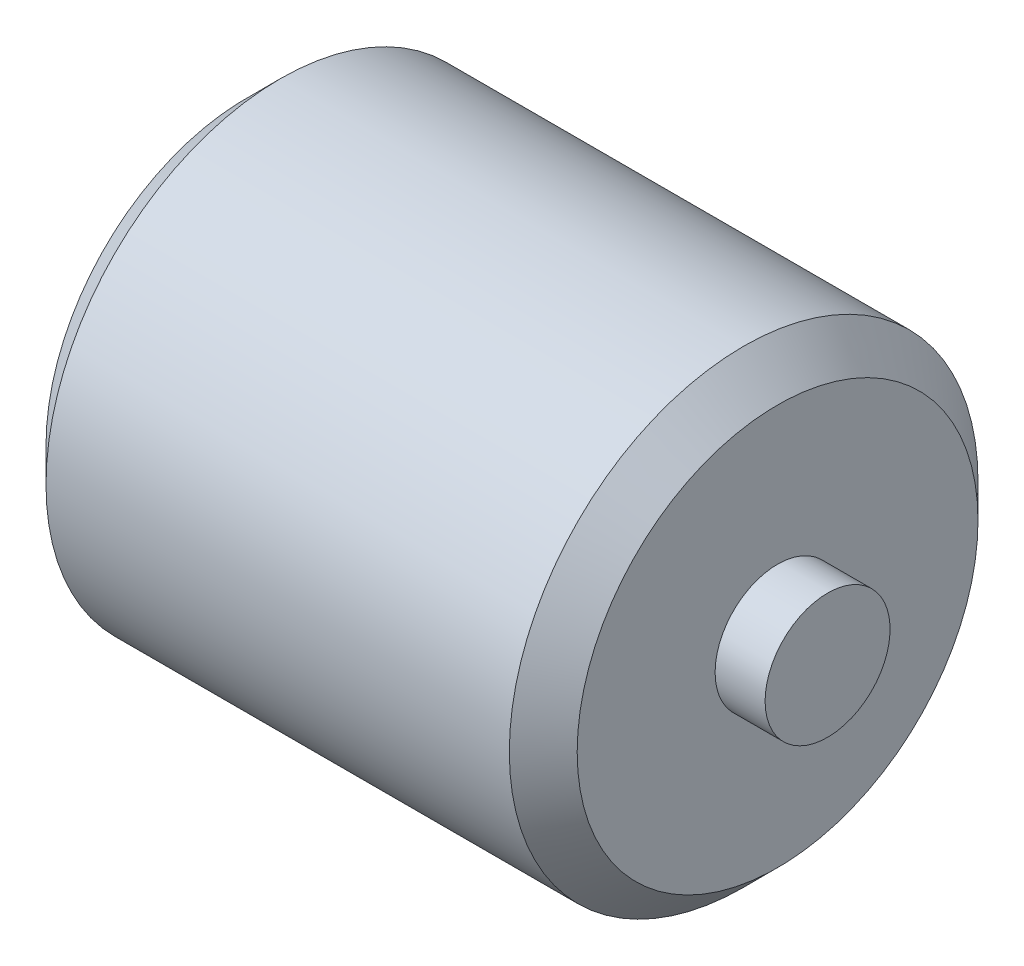
ISO-10303-21;
HEADER;
FILE_DESCRIPTION(('STEP AP214'),'2;1');
FILE_NAME('part.step','',(''),(''),'','','');
FILE_SCHEMA(('AUTOMOTIVE_DESIGN { 1 0 10303 214 1 1 1 1 }'));
ENDSEC;
DATA;
#1=APPLICATION_CONTEXT('core data for automotive mechanical design processes');
#2=APPLICATION_PROTOCOL_DEFINITION('international standard','automotive_design',2000,#1);
#3=PRODUCT_CONTEXT('',#1,'mechanical');
#4=PRODUCT('Part','Part','',(#3));
#5=PRODUCT_RELATED_PRODUCT_CATEGORY('part','',(#4));
#6=PRODUCT_DEFINITION_FORMATION('','',#4);
#7=PRODUCT_DEFINITION_CONTEXT('part definition',#1,'design');
#8=PRODUCT_DEFINITION('design','',#6,#7);
#9=PRODUCT_DEFINITION_SHAPE('','',#8);
#10=(LENGTH_UNIT() NAMED_UNIT(*) SI_UNIT(.MILLI.,.METRE.));
#11=(NAMED_UNIT(*) PLANE_ANGLE_UNIT() SI_UNIT($,.RADIAN.));
#12=(NAMED_UNIT(*) SI_UNIT($,.STERADIAN.) SOLID_ANGLE_UNIT());
#13=UNCERTAINTY_MEASURE_WITH_UNIT(LENGTH_MEASURE(1.E-05),#10,'distance_accuracy_value','');
#14=(GEOMETRIC_REPRESENTATION_CONTEXT(3) GLOBAL_UNCERTAINTY_ASSIGNED_CONTEXT((#13)) GLOBAL_UNIT_ASSIGNED_CONTEXT((#10,
#11,#12)) REPRESENTATION_CONTEXT('',''));
#15=CARTESIAN_POINT('',(0.,0.,0.));
#16=DIRECTION('',(0.,0.,1.));
#17=DIRECTION('',(1.,0.,0.));
#18=AXIS2_PLACEMENT_3D('',#15,#16,#17);
#19=CARTESIAN_POINT('',(-10.,10.,0.));
#20=DIRECTION('',(1.,0.,0.));
#21=DIRECTION('',(0.,0.,-1.));
#22=AXIS2_PLACEMENT_3D('',#19,#20,#21);
#23=PLANE('',#22);
#24=CARTESIAN_POINT('',(-10.,0.,0.));
#25=DIRECTION('',(-1.,0.,0.));
#26=DIRECTION('',(0.,0.,1.));
#27=AXIS2_PLACEMENT_3D('',#24,#25,#26);
#28=CIRCLE('',#27,20.);
#29=CARTESIAN_POINT('',(-10.,0.,20.));
#30=VERTEX_POINT('',#29);
#31=EDGE_CURVE('E10',#30,#30,#28,.T.);
#32=ORIENTED_EDGE('',*,*,#31,.T.);
#33=EDGE_LOOP('',(#32));
#34=FACE_BOUND('',#33,.T.);
#35=ADVANCED_FACE('F38',(#34),#23,.F.);
#36=CARTESIAN_POINT('',(0.,0.,0.));
#37=DIRECTION('',(-1.,0.,0.));
#38=DIRECTION('',(0.,0.,1.));
#39=AXIS2_PLACEMENT_3D('',#36,#37,#38);
#40=CYLINDRICAL_SURFACE('',#39,20.);
#41=ORIENTED_EDGE('',*,*,#31,.F.);
#42=EDGE_LOOP('',(#41));
#43=FACE_BOUND('',#42,.T.);
#44=CARTESIAN_POINT('',(5.99999999999999,0.,0.));
#45=DIRECTION('',(-1.,0.,0.));
#46=DIRECTION('',(0.,0.,1.));
#47=AXIS2_PLACEMENT_3D('',#44,#45,#46);
#48=CIRCLE('',#47,20.);
#49=CARTESIAN_POINT('',(5.99999999999999,0.,20.));
#50=VERTEX_POINT('',#49);
#51=EDGE_CURVE('E46',#50,#50,#48,.T.);
#52=ORIENTED_EDGE('',*,*,#51,.T.);
#53=EDGE_LOOP('',(#52));
#54=FACE_BOUND('',#53,.T.);
#55=ADVANCED_FACE('F162',(#43,#54),#40,.T.);
#56=CARTESIAN_POINT('',(5.99999999999999,60.,0.));
#57=DIRECTION('',(1.,0.,0.));
#58=DIRECTION('',(0.,0.,-1.));
#59=AXIS2_PLACEMENT_3D('',#56,#57,#58);
#60=PLANE('',#59);
#61=ORIENTED_EDGE('',*,*,#51,.F.);
#62=EDGE_LOOP('',(#61));
#63=FACE_BOUND('',#62,.T.);
#64=CARTESIAN_POINT('',(5.99999999999999,0.,0.));
#65=DIRECTION('',(-1.,0.,0.));
#66=DIRECTION('',(0.,0.,1.));
#67=AXIS2_PLACEMENT_3D('',#64,#65,#66);
#68=CIRCLE('',#67,64.142135623731);
#69=CARTESIAN_POINT('',(5.99999999999999,0.,64.142135623731));
#70=VERTEX_POINT('',#69);
#71=EDGE_CURVE('E51',#70,#70,#68,.T.);
#72=ORIENTED_EDGE('',*,*,#71,.T.);
#73=EDGE_LOOP('',(#72));
#74=FACE_BOUND('',#73,.T.);
#75=ADVANCED_FACE('F159',(#63,#74),#60,.F.);
#76=CARTESIAN_POINT('',(16.857864376269,0.,0.));
#77=DIRECTION('',(1.,0.,0.));
#78=DIRECTION('',(0.,0.,-1.));
#79=AXIS2_PLACEMENT_3D('',#76,#77,#78);
#80=CONICAL_SURFACE('',#79,75.,0.785398163397449);
#81=ORIENTED_EDGE('',*,*,#71,.F.);
#82=EDGE_LOOP('',(#81));
#83=FACE_BOUND('',#82,.T.);
#84=CARTESIAN_POINT('',(16.857864376269,0.,0.));
#85=DIRECTION('',(-1.,0.,0.));
#86=DIRECTION('',(0.,0.,1.));
#87=AXIS2_PLACEMENT_3D('',#84,#85,#86);
#88=CIRCLE('',#87,75.);
#89=CARTESIAN_POINT('',(16.857864376269,0.,75.));
#90=VERTEX_POINT('',#89);
#91=EDGE_CURVE('E56',#90,#90,#88,.T.);
#92=ORIENTED_EDGE('',*,*,#91,.T.);
#93=EDGE_LOOP('',(#92));
#94=FACE_BOUND('',#93,.T.);
#95=ADVANCED_FACE('F155',(#83,#94),#80,.T.);
#96=CARTESIAN_POINT('',(0.,0.,0.));
#97=DIRECTION('',(-1.,0.,0.));
#98=DIRECTION('',(0.,0.,1.));
#99=AXIS2_PLACEMENT_3D('',#96,#97,#98);
#100=CYLINDRICAL_SURFACE('',#99,75.);
#101=ORIENTED_EDGE('',*,*,#91,.F.);
#102=EDGE_LOOP('',(#101));
#103=FACE_BOUND('',#102,.T.);
#104=CARTESIAN_POINT('',(165.142135623731,0.,0.));
#105=DIRECTION('',(-1.,0.,0.));
#106=DIRECTION('',(0.,0.,1.));
#107=AXIS2_PLACEMENT_3D('',#104,#105,#106);
#108=CIRCLE('',#107,75.);
#109=CARTESIAN_POINT('',(165.142135623731,0.,75.));
#110=VERTEX_POINT('',#109);
#111=EDGE_CURVE('E62',#110,#110,#108,.T.);
#112=ORIENTED_EDGE('',*,*,#111,.T.);
#113=EDGE_LOOP('',(#112));
#114=FACE_BOUND('',#113,.T.);
#115=ADVANCED_FACE('F151',(#103,#114),#100,.T.);
#116=CARTESIAN_POINT('',(176.,0.,0.));
#117=DIRECTION('',(-1.,0.,0.));
#118=DIRECTION('',(0.,0.,1.));
#119=AXIS2_PLACEMENT_3D('',#116,#117,#118);
#120=CONICAL_SURFACE('',#119,64.142135623731,0.785398163397448);
#121=ORIENTED_EDGE('',*,*,#111,.F.);
#122=EDGE_LOOP('',(#121));
#123=FACE_BOUND('',#122,.T.);
#124=CARTESIAN_POINT('',(176.,0.,0.));
#125=DIRECTION('',(-1.,0.,0.));
#126=DIRECTION('',(0.,0.,1.));
#127=AXIS2_PLACEMENT_3D('',#124,#125,#126);
#128=CIRCLE('',#127,64.142135623731);
#129=CARTESIAN_POINT('',(176.,0.,64.142135623731));
#130=VERTEX_POINT('',#129);
#131=EDGE_CURVE('E66',#130,#130,#128,.T.);
#132=ORIENTED_EDGE('',*,*,#131,.T.);
#133=EDGE_LOOP('',(#132));
#134=FACE_BOUND('',#133,.T.);
#135=ADVANCED_FACE('F147',(#123,#134),#120,.T.);
#136=CARTESIAN_POINT('',(176.,10.,0.));
#137=DIRECTION('',(-1.,0.,0.));
#138=DIRECTION('',(0.,0.,1.));
#139=AXIS2_PLACEMENT_3D('',#136,#137,#138);
#140=PLANE('',#139);
#141=ORIENTED_EDGE('',*,*,#131,.F.);
#142=EDGE_LOOP('',(#141));
#143=FACE_BOUND('',#142,.T.);
#144=CARTESIAN_POINT('',(176.,0.,0.));
#145=DIRECTION('',(-1.,0.,0.));
#146=DIRECTION('',(0.,0.,1.));
#147=AXIS2_PLACEMENT_3D('',#144,#145,#146);
#148=CIRCLE('',#147,20.);
#149=CARTESIAN_POINT('',(176.,0.,20.));
#150=VERTEX_POINT('',#149);
#151=EDGE_CURVE('E70',#150,#150,#148,.T.);
#152=ORIENTED_EDGE('',*,*,#151,.T.);
#153=EDGE_LOOP('',(#152));
#154=FACE_BOUND('',#153,.T.);
#155=ADVANCED_FACE('F143',(#143,#154),#140,.F.);
#156=CARTESIAN_POINT('',(0.,0.,0.));
#157=DIRECTION('',(-1.,0.,0.));
#158=DIRECTION('',(0.,0.,1.));
#159=AXIS2_PLACEMENT_3D('',#156,#157,#158);
#160=CYLINDRICAL_SURFACE('',#159,20.);
#161=ORIENTED_EDGE('',*,*,#151,.F.);
#162=EDGE_LOOP('',(#161));
#163=FACE_BOUND('',#162,.T.);
#164=CARTESIAN_POINT('',(192.,0.,0.));
#165=DIRECTION('',(-1.,0.,0.));
#166=DIRECTION('',(0.,0.,1.));
#167=AXIS2_PLACEMENT_3D('',#164,#165,#166);
#168=CIRCLE('',#167,20.);
#169=CARTESIAN_POINT('',(192.,0.,20.));
#170=VERTEX_POINT('',#169);
#171=EDGE_CURVE('E74',#170,#170,#168,.T.);
#172=ORIENTED_EDGE('',*,*,#171,.T.);
#173=EDGE_LOOP('',(#172));
#174=FACE_BOUND('',#173,.T.);
#175=ADVANCED_FACE('F139',(#163,#174),#160,.T.);
#176=CARTESIAN_POINT('',(192.,0.,0.));
#177=DIRECTION('',(-1.,0.,0.));
#178=DIRECTION('',(0.,0.,1.));
#179=AXIS2_PLACEMENT_3D('',#176,#177,#178);
#180=PLANE('',#179);
#181=ORIENTED_EDGE('',*,*,#171,.F.);
#182=EDGE_LOOP('',(#181));
#183=FACE_BOUND('',#182,.T.);
#184=ADVANCED_FACE('F137',(#183),#180,.F.);
#185=CLOSED_SHELL('',(#35,#55,#75,#95,#115,#135,#155,#175,#184));
#186=CARTESIAN_POINT('',(182.,0.,0.));
#187=DIRECTION('',(-1.,0.,0.));
#188=DIRECTION('',(0.,0.,1.));
#189=AXIS2_PLACEMENT_3D('',#186,#187,#188);
#190=PLANE('',#189);
#191=CARTESIAN_POINT('',(182.,0.,0.));
#192=DIRECTION('',(-1.,0.,0.));
#193=DIRECTION('',(0.,0.,1.));
#194=AXIS2_PLACEMENT_3D('',#191,#192,#193);
#195=CIRCLE('',#194,10.);
#196=CARTESIAN_POINT('',(182.,0.,10.));
#197=VERTEX_POINT('',#196);
#198=EDGE_CURVE('E78',#197,#197,#195,.T.);
#199=ORIENTED_EDGE('',*,*,#198,.T.);
#200=EDGE_LOOP('',(#199));
#201=FACE_BOUND('',#200,.T.);
#202=ADVANCED_FACE('F123',(#201),#190,.T.);
#203=CARTESIAN_POINT('',(0.,0.,0.));
#204=DIRECTION('',(-1.,0.,0.));
#205=DIRECTION('',(0.,0.,1.));
#206=AXIS2_PLACEMENT_3D('',#203,#204,#205);
#207=CYLINDRICAL_SURFACE('',#206,10.);
#208=CARTESIAN_POINT('',(166.,0.,0.));
#209=DIRECTION('',(-1.,0.,0.));
#210=DIRECTION('',(0.,0.,1.));
#211=AXIS2_PLACEMENT_3D('',#208,#209,#210);
#212=CIRCLE('',#211,10.);
#213=CARTESIAN_POINT('',(166.,0.,10.));
#214=VERTEX_POINT('',#213);
#215=EDGE_CURVE('E82',#214,#214,#212,.T.);
#216=ORIENTED_EDGE('',*,*,#215,.T.);
#217=EDGE_LOOP('',(#216));
#218=FACE_BOUND('',#217,.T.);
#219=ORIENTED_EDGE('',*,*,#198,.F.);
#220=EDGE_LOOP('',(#219));
#221=FACE_BOUND('',#220,.T.);
#222=ADVANCED_FACE('F125',(#218,#221),#207,.F.);
#223=CARTESIAN_POINT('',(166.,10.,0.));
#224=DIRECTION('',(-1.,0.,0.));
#225=DIRECTION('',(0.,0.,1.));
#226=AXIS2_PLACEMENT_3D('',#223,#224,#225);
#227=PLANE('',#226);
#228=CARTESIAN_POINT('',(166.,0.,0.));
#229=DIRECTION('',(-1.,0.,0.));
#230=DIRECTION('',(0.,0.,1.));
#231=AXIS2_PLACEMENT_3D('',#228,#229,#230);
#232=CIRCLE('',#231,60.);
#233=CARTESIAN_POINT('',(166.,0.,60.));
#234=VERTEX_POINT('',#233);
#235=EDGE_CURVE('E86',#234,#234,#232,.T.);
#236=ORIENTED_EDGE('',*,*,#235,.T.);
#237=EDGE_LOOP('',(#236));
#238=FACE_BOUND('',#237,.T.);
#239=ORIENTED_EDGE('',*,*,#215,.F.);
#240=EDGE_LOOP('',(#239));
#241=FACE_BOUND('',#240,.T.);
#242=ADVANCED_FACE('F132',(#238,#241),#227,.T.);
#243=CARTESIAN_POINT('',(166.,0.,0.));
#244=DIRECTION('',(-1.,0.,0.));
#245=DIRECTION('',(0.,0.,1.));
#246=AXIS2_PLACEMENT_3D('',#243,#244,#245);
#247=CONICAL_SURFACE('',#246,60.,0.785398163397448);
#248=CARTESIAN_POINT('',(161.,0.,0.));
#249=DIRECTION('',(-1.,0.,0.));
#250=DIRECTION('',(0.,0.,1.));
#251=AXIS2_PLACEMENT_3D('',#248,#249,#250);
#252=CIRCLE('',#251,65.);
#253=CARTESIAN_POINT('',(161.,0.,65.));
#254=VERTEX_POINT('',#253);
#255=EDGE_CURVE('E90',#254,#254,#252,.T.);
#256=ORIENTED_EDGE('',*,*,#255,.T.);
#257=EDGE_LOOP('',(#256));
#258=FACE_BOUND('',#257,.T.);
#259=ORIENTED_EDGE('',*,*,#235,.F.);
#260=EDGE_LOOP('',(#259));
#261=FACE_BOUND('',#260,.T.);
#262=ADVANCED_FACE('F236',(#258,#261),#247,.F.);
#263=CARTESIAN_POINT('',(0.,0.,0.));
#264=DIRECTION('',(-1.,0.,0.));
#265=DIRECTION('',(0.,0.,1.));
#266=AXIS2_PLACEMENT_3D('',#263,#264,#265);
#267=CYLINDRICAL_SURFACE('',#266,65.);
#268=CARTESIAN_POINT('',(21.,0.,0.));
#269=DIRECTION('',(-1.,0.,0.));
#270=DIRECTION('',(0.,0.,1.));
#271=AXIS2_PLACEMENT_3D('',#268,#269,#270);
#272=CIRCLE('',#271,65.);
#273=CARTESIAN_POINT('',(21.,0.,65.));
#274=VERTEX_POINT('',#273);
#275=EDGE_CURVE('E94',#274,#274,#272,.T.);
#276=ORIENTED_EDGE('',*,*,#275,.T.);
#277=EDGE_LOOP('',(#276));
#278=FACE_BOUND('',#277,.T.);
#279=ORIENTED_EDGE('',*,*,#255,.F.);
#280=EDGE_LOOP('',(#279));
#281=FACE_BOUND('',#280,.T.);
#282=ADVANCED_FACE('F245',(#278,#281),#267,.F.);
#283=CARTESIAN_POINT('',(21.,0.,0.));
#284=DIRECTION('',(1.,0.,0.));
#285=DIRECTION('',(0.,0.,-1.));
#286=AXIS2_PLACEMENT_3D('',#283,#284,#285);
#287=CONICAL_SURFACE('',#286,65.,0.785398163397449);
#288=CARTESIAN_POINT('',(16.,0.,0.));
#289=DIRECTION('',(-1.,0.,0.));
#290=DIRECTION('',(0.,0.,1.));
#291=AXIS2_PLACEMENT_3D('',#288,#289,#290);
#292=CIRCLE('',#291,60.);
#293=CARTESIAN_POINT('',(16.,0.,60.));
#294=VERTEX_POINT('',#293);
#295=EDGE_CURVE('E98',#294,#294,#292,.T.);
#296=ORIENTED_EDGE('',*,*,#295,.T.);
#297=EDGE_LOOP('',(#296));
#298=FACE_BOUND('',#297,.T.);
#299=ORIENTED_EDGE('',*,*,#275,.F.);
#300=EDGE_LOOP('',(#299));
#301=FACE_BOUND('',#300,.T.);
#302=ADVANCED_FACE('F255',(#298,#301),#287,.F.);
#303=CARTESIAN_POINT('',(16.,60.,0.));
#304=DIRECTION('',(1.,0.,0.));
#305=DIRECTION('',(0.,0.,-1.));
#306=AXIS2_PLACEMENT_3D('',#303,#304,#305);
#307=PLANE('',#306);
#308=CARTESIAN_POINT('',(16.,0.,0.));
#309=DIRECTION('',(-1.,0.,0.));
#310=DIRECTION('',(0.,0.,1.));
#311=AXIS2_PLACEMENT_3D('',#308,#309,#310);
#312=CIRCLE('',#311,10.);
#313=CARTESIAN_POINT('',(16.,0.,10.));
#314=VERTEX_POINT('',#313);
#315=EDGE_CURVE('E102',#314,#314,#312,.T.);
#316=ORIENTED_EDGE('',*,*,#315,.T.);
#317=EDGE_LOOP('',(#316));
#318=FACE_BOUND('',#317,.T.);
#319=ORIENTED_EDGE('',*,*,#295,.F.);
#320=EDGE_LOOP('',(#319));
#321=FACE_BOUND('',#320,.T.);
#322=ADVANCED_FACE('F121',(#318,#321),#307,.T.);
#323=CARTESIAN_POINT('',(0.,0.,0.));
#324=DIRECTION('',(-1.,0.,0.));
#325=DIRECTION('',(0.,0.,1.));
#326=AXIS2_PLACEMENT_3D('',#323,#324,#325);
#327=CYLINDRICAL_SURFACE('',#326,10.);
#328=CARTESIAN_POINT('',(0.,0.,0.));
#329=DIRECTION('',(-1.,0.,0.));
#330=DIRECTION('',(0.,0.,1.));
#331=AXIS2_PLACEMENT_3D('',#328,#329,#330);
#332=CIRCLE('',#331,10.);
#333=CARTESIAN_POINT('',(0.,0.,10.));
#334=VERTEX_POINT('',#333);
#335=EDGE_CURVE('E106',#334,#334,#332,.T.);
#336=ORIENTED_EDGE('',*,*,#335,.T.);
#337=EDGE_LOOP('',(#336));
#338=FACE_BOUND('',#337,.T.);
#339=ORIENTED_EDGE('',*,*,#315,.F.);
#340=EDGE_LOOP('',(#339));
#341=FACE_BOUND('',#340,.T.);
#342=ADVANCED_FACE('F111',(#338,#341),#327,.F.);
#343=CARTESIAN_POINT('',(0.,10.,0.));
#344=DIRECTION('',(1.,0.,0.));
#345=DIRECTION('',(0.,0.,-1.));
#346=AXIS2_PLACEMENT_3D('',#343,#344,#345);
#347=PLANE('',#346);
#348=ORIENTED_EDGE('',*,*,#335,.F.);
#349=EDGE_LOOP('',(#348));
#350=FACE_BOUND('',#349,.T.);
#351=ADVANCED_FACE('F114',(#350),#347,.T.);
#352=CLOSED_SHELL('',(#202,#222,#242,#262,#282,#302,#322,#342,#351));
#353=ORIENTED_CLOSED_SHELL('',*,#352,.T.);
#354=BREP_WITH_VOIDS('B2',#185,(#353));
#355=ADVANCED_BREP_SHAPE_REPRESENTATION('',(#18,#354),#14);
#356=SHAPE_DEFINITION_REPRESENTATION(#9,#355);
ENDSEC;
END-ISO-10303-21;
